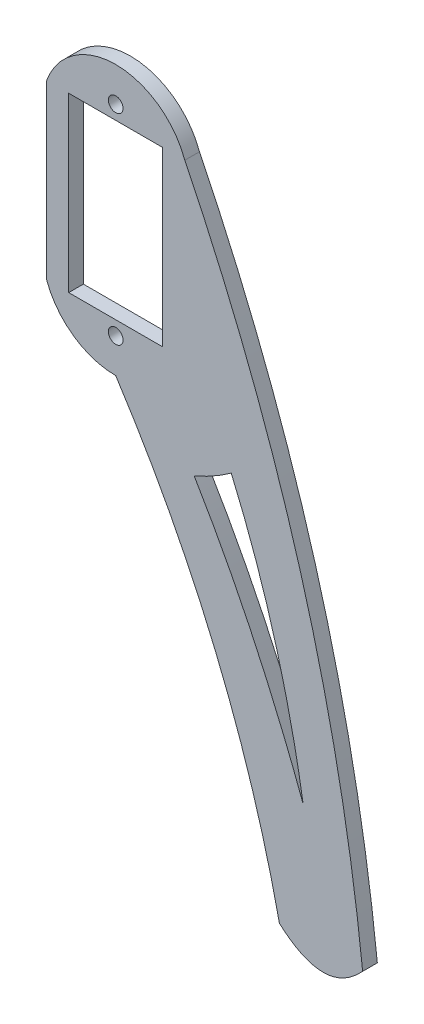
ISO-10303-21;
HEADER;
FILE_DESCRIPTION(('STEP AP214'),'2;1');
FILE_NAME('part.step','',(''),(''),'','','');
FILE_SCHEMA(('AUTOMOTIVE_DESIGN { 1 0 10303 214 1 1 1 1 }'));
ENDSEC;
DATA;
#1=APPLICATION_CONTEXT('core data for automotive mechanical design processes');
#2=APPLICATION_PROTOCOL_DEFINITION('international standard','automotive_design',2000,#1);
#3=PRODUCT_CONTEXT('',#1,'mechanical');
#4=PRODUCT('Part','Part','',(#3));
#5=PRODUCT_RELATED_PRODUCT_CATEGORY('part','',(#4));
#6=PRODUCT_DEFINITION_FORMATION('','',#4);
#7=PRODUCT_DEFINITION_CONTEXT('part definition',#1,'design');
#8=PRODUCT_DEFINITION('design','',#6,#7);
#9=PRODUCT_DEFINITION_SHAPE('','',#8);
#10=(LENGTH_UNIT() NAMED_UNIT(*) SI_UNIT(.MILLI.,.METRE.));
#11=(NAMED_UNIT(*) PLANE_ANGLE_UNIT() SI_UNIT($,.RADIAN.));
#12=(NAMED_UNIT(*) SI_UNIT($,.STERADIAN.) SOLID_ANGLE_UNIT());
#13=UNCERTAINTY_MEASURE_WITH_UNIT(LENGTH_MEASURE(1.E-05),#10,'distance_accuracy_value','');
#14=(GEOMETRIC_REPRESENTATION_CONTEXT(3) GLOBAL_UNCERTAINTY_ASSIGNED_CONTEXT((#13)) GLOBAL_UNIT_ASSIGNED_CONTEXT((#10,
#11,#12)) REPRESENTATION_CONTEXT('',''));
#15=CARTESIAN_POINT('',(0.,0.,0.));
#16=DIRECTION('',(0.,0.,1.));
#17=DIRECTION('',(1.,0.,0.));
#18=AXIS2_PLACEMENT_3D('',#15,#16,#17);
#19=CARTESIAN_POINT('',(10.6799037739265,-24.8169992032956,2.));
#20=CARTESIAN_POINT('',(19.0881977067008,-38.8472866210314,2.));
#21=CARTESIAN_POINT('',(25.511369442718,-56.0771893153706,2.));
#22=B_SPLINE_CURVE_WITH_KNOTS('',2,(#19,#20,#21),.UNSPECIFIED.,.F.,.F.,(3,3),(0.,1.),.UNSPECIFIED.);
#23=DIRECTION('',(0.,0.,-1.));
#24=VECTOR('',#23,1.);
#25=SURFACE_OF_LINEAR_EXTRUSION('',#22,#24);
#26=CARTESIAN_POINT('',(10.6799037739265,-24.8169992032956,0.));
#27=CARTESIAN_POINT('',(19.0881977067008,-38.8472866210314,0.));
#28=CARTESIAN_POINT('',(25.511369442718,-56.0771893153706,0.));
#29=B_SPLINE_CURVE_WITH_KNOTS('',2,(#26,#27,#28),.UNSPECIFIED.,.F.,.F.,(3,3),(0.,1.),.UNSPECIFIED.);
#30=CARTESIAN_POINT('',(10.6799037739265,-24.8169992032956,0.));
#31=VERTEX_POINT('',#30);
#32=CARTESIAN_POINT('',(25.511369442718,-56.0771893153706,0.));
#33=VERTEX_POINT('',#32);
#34=EDGE_CURVE('E145',#31,#33,#29,.T.);
#35=ORIENTED_EDGE('',*,*,#34,.F.);
#36=DIRECTION('',(0.,0.,-1.));
#37=VECTOR('',#36,1.);
#38=CARTESIAN_POINT('',(10.6799037739265,-24.8169992032956,2.));
#39=LINE('',#38,#37);
#40=CARTESIAN_POINT('',(10.6799037739265,-24.8169992032956,2.));
#41=VERTEX_POINT('',#40);
#42=EDGE_CURVE('E11',#41,#31,#39,.T.);
#43=ORIENTED_EDGE('',*,*,#42,.F.);
#44=CARTESIAN_POINT('',(25.511369442718,-56.0771893153706,2.));
#45=VERTEX_POINT('',#44);
#46=EDGE_CURVE('E144',#41,#45,#22,.T.);
#47=ORIENTED_EDGE('',*,*,#46,.T.);
#48=DIRECTION('',(0.,0.,-1.));
#49=VECTOR('',#48,1.);
#50=CARTESIAN_POINT('',(25.511369442718,-56.0771893153706,2.));
#51=LINE('',#50,#49);
#52=EDGE_CURVE('E107',#45,#33,#51,.T.);
#53=ORIENTED_EDGE('',*,*,#52,.T.);
#54=EDGE_LOOP('',(#35,#43,#47,#53));
#55=FACE_BOUND('',#54,.T.);
#56=ADVANCED_FACE('F38',(#55),#25,.T.);
#57=CARTESIAN_POINT('',(0.,0.,2.));
#58=DIRECTION('',(0.,0.,-1.));
#59=DIRECTION('',(-1.,0.,0.));
#60=AXIS2_PLACEMENT_3D('',#57,#58,#59);
#61=CYLINDRICAL_SURFACE('',#60,27.0174720149148);
#62=CARTESIAN_POINT('',(0.,0.,0.));
#63=DIRECTION('',(0.,0.,1.));
#64=DIRECTION('',(1.,0.,0.));
#65=AXIS2_PLACEMENT_3D('',#62,#63,#64);
#66=CIRCLE('',#65,27.0174720149148);
#67=CARTESIAN_POINT('',(15.7256652386891,-21.9692340985613,0.));
#68=VERTEX_POINT('',#67);
#69=EDGE_CURVE('E243',#31,#68,#66,.T.);
#70=ORIENTED_EDGE('',*,*,#69,.T.);
#71=DIRECTION('',(0.,0.,-1.));
#72=VECTOR('',#71,1.);
#73=CARTESIAN_POINT('',(15.7256652386891,-21.9692340985613,2.));
#74=LINE('',#73,#72);
#75=CARTESIAN_POINT('',(15.7256652386891,-21.9692340985613,2.));
#76=VERTEX_POINT('',#75);
#77=EDGE_CURVE('E48',#76,#68,#74,.T.);
#78=ORIENTED_EDGE('',*,*,#77,.F.);
#79=CARTESIAN_POINT('',(0.,0.,2.));
#80=DIRECTION('',(0.,0.,1.));
#81=DIRECTION('',(1.,0.,0.));
#82=AXIS2_PLACEMENT_3D('',#79,#80,#81);
#83=CIRCLE('',#82,27.0174720149148);
#84=EDGE_CURVE('E149',#41,#76,#83,.T.);
#85=ORIENTED_EDGE('',*,*,#84,.F.);
#86=ORIENTED_EDGE('',*,*,#42,.T.);
#87=EDGE_LOOP('',(#70,#78,#85,#86));
#88=FACE_BOUND('',#87,.T.);
#89=ADVANCED_FACE('F150',(#88),#61,.T.);
#90=CARTESIAN_POINT('',(-9.4,0.,2.));
#91=DIRECTION('',(-1.,0.,0.));
#92=DIRECTION('',(0.,0.,1.));
#93=AXIS2_PLACEMENT_3D('',#90,#91,#92);
#94=PLANE('',#93);
#95=DIRECTION('',(0.,1.,0.));
#96=VECTOR('',#95,1.);
#97=CARTESIAN_POINT('',(-9.4,0.,0.));
#98=LINE('',#97,#96);
#99=CARTESIAN_POINT('',(-9.4,-11.75,0.));
#100=VERTEX_POINT('',#99);
#101=CARTESIAN_POINT('',(-9.4,11.75,0.));
#102=VERTEX_POINT('',#101);
#103=EDGE_CURVE('E295',#100,#102,#98,.T.);
#104=ORIENTED_EDGE('',*,*,#103,.F.);
#105=DIRECTION('',(0.,0.,-1.));
#106=VECTOR('',#105,1.);
#107=CARTESIAN_POINT('',(-9.4,-11.75,2.));
#108=LINE('',#107,#106);
#109=CARTESIAN_POINT('',(-9.4,-11.75,2.));
#110=VERTEX_POINT('',#109);
#111=EDGE_CURVE('E221',#110,#100,#108,.T.);
#112=ORIENTED_EDGE('',*,*,#111,.F.);
#113=DIRECTION('',(0.,1.,0.));
#114=VECTOR('',#113,1.);
#115=CARTESIAN_POINT('',(-9.4,0.,2.));
#116=LINE('',#115,#114);
#117=CARTESIAN_POINT('',(-9.4,11.75,2.));
#118=VERTEX_POINT('',#117);
#119=EDGE_CURVE('E219',#110,#118,#116,.T.);
#120=ORIENTED_EDGE('',*,*,#119,.T.);
#121=DIRECTION('',(0.,0.,-1.));
#122=VECTOR('',#121,1.);
#123=CARTESIAN_POINT('',(-9.4,11.75,2.));
#124=LINE('',#123,#122);
#125=EDGE_CURVE('E211',#118,#102,#124,.T.);
#126=ORIENTED_EDGE('',*,*,#125,.T.);
#127=EDGE_LOOP('',(#104,#112,#120,#126));
#128=FACE_BOUND('',#127,.T.);
#129=ADVANCED_FACE('F220',(#128),#94,.T.);
#130=CARTESIAN_POINT('',(0.,-8.33825557815361,2.));
#131=DIRECTION('',(0.,0.,-1.));
#132=DIRECTION('',(-1.,0.,0.));
#133=AXIS2_PLACEMENT_3D('',#130,#131,#132);
#134=CYLINDRICAL_SURFACE('',#133,10.);
#135=CARTESIAN_POINT('',(0.,-8.33825557815361,0.));
#136=DIRECTION('',(0.,0.,1.));
#137=DIRECTION('',(1.,0.,0.));
#138=AXIS2_PLACEMENT_3D('',#135,#136,#137);
#139=CIRCLE('',#138,10.);
#140=CARTESIAN_POINT('',(0.,-18.3382555781536,0.));
#141=VERTEX_POINT('',#140);
#142=EDGE_CURVE('E297',#100,#141,#139,.T.);
#143=ORIENTED_EDGE('',*,*,#142,.T.);
#144=DIRECTION('',(0.,0.,-1.));
#145=VECTOR('',#144,1.);
#146=CARTESIAN_POINT('',(0.,-18.3382555781536,2.));
#147=LINE('',#146,#145);
#148=CARTESIAN_POINT('',(0.,-18.3382555781536,2.));
#149=VERTEX_POINT('',#148);
#150=EDGE_CURVE('E260',#149,#141,#147,.T.);
#151=ORIENTED_EDGE('',*,*,#150,.F.);
#152=CARTESIAN_POINT('',(0.,-8.33825557815361,2.));
#153=DIRECTION('',(0.,0.,1.));
#154=DIRECTION('',(1.,0.,0.));
#155=AXIS2_PLACEMENT_3D('',#152,#153,#154);
#156=CIRCLE('',#155,10.);
#157=EDGE_CURVE('E224',#110,#149,#156,.T.);
#158=ORIENTED_EDGE('',*,*,#157,.F.);
#159=ORIENTED_EDGE('',*,*,#111,.T.);
#160=EDGE_LOOP('',(#143,#151,#158,#159));
#161=FACE_BOUND('',#160,.T.);
#162=ADVANCED_FACE('F360',(#161),#134,.T.);
#163=CARTESIAN_POINT('',(-134.091519092015,-105.627799669046,2.));
#164=DIRECTION('',(0.,0.,-1.));
#165=DIRECTION('',(-1.,0.,0.));
#166=AXIS2_PLACEMENT_3D('',#163,#164,#165);
#167=CYLINDRICAL_SURFACE('',#166,160.);
#168=CARTESIAN_POINT('',(-134.091519092015,-105.627799669046,0.));
#169=DIRECTION('',(0.,0.,1.));
#170=DIRECTION('',(1.,0.,0.));
#171=AXIS2_PLACEMENT_3D('',#168,#169,#170);
#172=CIRCLE('',#171,160.);
#173=CARTESIAN_POINT('',(22.2807760551242,-71.75,0.));
#174=VERTEX_POINT('',#173);
#175=EDGE_CURVE('E300',#141,#174,#172,.F.);
#176=ORIENTED_EDGE('',*,*,#175,.T.);
#177=DIRECTION('',(0.,0.,-1.));
#178=VECTOR('',#177,1.);
#179=CARTESIAN_POINT('',(22.2807760551242,-71.75,2.));
#180=LINE('',#179,#178);
#181=CARTESIAN_POINT('',(22.2807760551242,-71.75,2.));
#182=VERTEX_POINT('',#181);
#183=EDGE_CURVE('E258',#182,#174,#180,.T.);
#184=ORIENTED_EDGE('',*,*,#183,.F.);
#185=CARTESIAN_POINT('',(-134.091519092015,-105.627799669046,2.));
#186=DIRECTION('',(0.,0.,1.));
#187=DIRECTION('',(1.,0.,0.));
#188=AXIS2_PLACEMENT_3D('',#185,#186,#187);
#189=CIRCLE('',#188,160.);
#190=EDGE_CURVE('E195',#149,#182,#189,.F.);
#191=ORIENTED_EDGE('',*,*,#190,.F.);
#192=ORIENTED_EDGE('',*,*,#150,.T.);
#193=EDGE_LOOP('',(#176,#184,#191,#192));
#194=FACE_BOUND('',#193,.T.);
#195=ADVANCED_FACE('F186',(#194),#167,.F.);
#196=CARTESIAN_POINT('',(33.6079623547485,-71.75,2.));
#197=CARTESIAN_POINT('',(28.503418883784,-77.3391353795696,2.));
#198=CARTESIAN_POINT('',(22.2807760551242,-71.75,2.));
#199=B_SPLINE_CURVE_WITH_KNOTS('',2,(#196,#197,#198),.UNSPECIFIED.,.F.,.F.,(3,3),(0.,1.),.UNSPECIFIED.);
#200=DIRECTION('',(0.,0.,-1.));
#201=VECTOR('',#200,1.);
#202=SURFACE_OF_LINEAR_EXTRUSION('',#199,#201);
#203=CARTESIAN_POINT('',(33.6079623547485,-71.75,0.));
#204=CARTESIAN_POINT('',(28.503418883784,-77.3391353795696,0.));
#205=CARTESIAN_POINT('',(22.2807760551242,-71.75,0.));
#206=B_SPLINE_CURVE_WITH_KNOTS('',2,(#203,#204,#205),.UNSPECIFIED.,.F.,.F.,(3,3),(0.,1.),.UNSPECIFIED.);
#207=CARTESIAN_POINT('',(33.6079623547485,-71.75,0.));
#208=VERTEX_POINT('',#207);
#209=EDGE_CURVE('E303',#208,#174,#206,.T.);
#210=ORIENTED_EDGE('',*,*,#209,.F.);
#211=DIRECTION('',(0.,0.,-1.));
#212=VECTOR('',#211,1.);
#213=CARTESIAN_POINT('',(33.6079623547485,-71.75,2.));
#214=LINE('',#213,#212);
#215=CARTESIAN_POINT('',(33.6079623547485,-71.75,2.));
#216=VERTEX_POINT('',#215);
#217=EDGE_CURVE('E203',#216,#208,#214,.T.);
#218=ORIENTED_EDGE('',*,*,#217,.F.);
#219=EDGE_CURVE('E189',#216,#182,#199,.T.);
#220=ORIENTED_EDGE('',*,*,#219,.T.);
#221=ORIENTED_EDGE('',*,*,#183,.T.);
#222=EDGE_LOOP('',(#210,#218,#220,#221));
#223=FACE_BOUND('',#222,.T.);
#224=ADVANCED_FACE('F181',(#223),#202,.T.);
#225=CARTESIAN_POINT('',(-214.951183758744,-98.5520686390348,2.));
#226=DIRECTION('',(0.,0.,-1.));
#227=DIRECTION('',(-1.,0.,0.));
#228=AXIS2_PLACEMENT_3D('',#225,#226,#227);
#229=CYLINDRICAL_SURFACE('',#228,250.);
#230=CARTESIAN_POINT('',(-214.951183758744,-98.5520686390348,0.));
#231=DIRECTION('',(0.,0.,1.));
#232=DIRECTION('',(1.,0.,0.));
#233=AXIS2_PLACEMENT_3D('',#230,#231,#232);
#234=CIRCLE('',#233,250.);
#235=CARTESIAN_POINT('',(9.4,11.75,0.));
#236=VERTEX_POINT('',#235);
#237=EDGE_CURVE('E308',#236,#208,#234,.F.);
#238=ORIENTED_EDGE('',*,*,#237,.F.);
#239=DIRECTION('',(0.,0.,-1.));
#240=VECTOR('',#239,1.);
#241=CARTESIAN_POINT('',(9.4,11.75,2.));
#242=LINE('',#241,#240);
#243=CARTESIAN_POINT('',(9.4,11.75,2.));
#244=VERTEX_POINT('',#243);
#245=EDGE_CURVE('E205',#244,#236,#242,.T.);
#246=ORIENTED_EDGE('',*,*,#245,.F.);
#247=CARTESIAN_POINT('',(-214.951183758744,-98.5520686390348,2.));
#248=DIRECTION('',(0.,0.,1.));
#249=DIRECTION('',(1.,0.,0.));
#250=AXIS2_PLACEMENT_3D('',#247,#248,#249);
#251=CIRCLE('',#250,250.);
#252=EDGE_CURVE('E156',#244,#216,#251,.F.);
#253=ORIENTED_EDGE('',*,*,#252,.T.);
#254=ORIENTED_EDGE('',*,*,#217,.T.);
#255=EDGE_LOOP('',(#238,#246,#253,#254));
#256=FACE_BOUND('',#255,.T.);
#257=ADVANCED_FACE('F177',(#256),#229,.T.);
#258=CARTESIAN_POINT('',(0.,-11.75,2.));
#259=DIRECTION('',(0.,-1.,0.));
#260=DIRECTION('',(0.,0.,-1.));
#261=AXIS2_PLACEMENT_3D('',#258,#259,#260);
#262=PLANE('',#261);
#263=DIRECTION('',(-1.,0.,0.));
#264=VECTOR('',#263,1.);
#265=CARTESIAN_POINT('',(0.,-11.75,0.));
#266=LINE('',#265,#264);
#267=CARTESIAN_POINT('',(6.4,-11.75,0.));
#268=VERTEX_POINT('',#267);
#269=CARTESIAN_POINT('',(-6.4,-11.75,0.));
#270=VERTEX_POINT('',#269);
#271=EDGE_CURVE('E279',#268,#270,#266,.T.);
#272=ORIENTED_EDGE('',*,*,#271,.T.);
#273=DIRECTION('',(0.,0.,-1.));
#274=VECTOR('',#273,1.);
#275=CARTESIAN_POINT('',(-6.4,-11.75,2.));
#276=LINE('',#275,#274);
#277=CARTESIAN_POINT('',(-6.4,-11.75,2.));
#278=VERTEX_POINT('',#277);
#279=EDGE_CURVE('E42',#278,#270,#276,.T.);
#280=ORIENTED_EDGE('',*,*,#279,.F.);
#281=DIRECTION('',(-1.,0.,0.));
#282=VECTOR('',#281,1.);
#283=CARTESIAN_POINT('',(0.,-11.75,2.));
#284=LINE('',#283,#282);
#285=CARTESIAN_POINT('',(6.4,-11.75,2.));
#286=VERTEX_POINT('',#285);
#287=EDGE_CURVE('E234',#286,#278,#284,.T.);
#288=ORIENTED_EDGE('',*,*,#287,.F.);
#289=DIRECTION('',(0.,0.,-1.));
#290=VECTOR('',#289,1.);
#291=CARTESIAN_POINT('',(6.4,-11.75,2.));
#292=LINE('',#291,#290);
#293=EDGE_CURVE('E264',#286,#268,#292,.T.);
#294=ORIENTED_EDGE('',*,*,#293,.T.);
#295=EDGE_LOOP('',(#272,#280,#288,#294));
#296=FACE_BOUND('',#295,.T.);
#297=ADVANCED_FACE('F180',(#296),#262,.F.);
#298=CARTESIAN_POINT('',(-6.4,0.,2.));
#299=DIRECTION('',(-1.,0.,0.));
#300=DIRECTION('',(0.,0.,1.));
#301=AXIS2_PLACEMENT_3D('',#298,#299,#300);
#302=PLANE('',#301);
#303=DIRECTION('',(0.,1.,0.));
#304=VECTOR('',#303,1.);
#305=CARTESIAN_POINT('',(-6.4,0.,0.));
#306=LINE('',#305,#304);
#307=CARTESIAN_POINT('',(-6.4,11.75,0.));
#308=VERTEX_POINT('',#307);
#309=EDGE_CURVE('E274',#270,#308,#306,.T.);
#310=ORIENTED_EDGE('',*,*,#309,.T.);
#311=DIRECTION('',(0.,0.,-1.));
#312=VECTOR('',#311,1.);
#313=CARTESIAN_POINT('',(-6.4,11.75,2.));
#314=LINE('',#313,#312);
#315=CARTESIAN_POINT('',(-6.4,11.75,2.));
#316=VERTEX_POINT('',#315);
#317=EDGE_CURVE('E267',#316,#308,#314,.T.);
#318=ORIENTED_EDGE('',*,*,#317,.F.);
#319=DIRECTION('',(0.,1.,0.));
#320=VECTOR('',#319,1.);
#321=CARTESIAN_POINT('',(-6.4,0.,2.));
#322=LINE('',#321,#320);
#323=EDGE_CURVE('E115',#278,#316,#322,.T.);
#324=ORIENTED_EDGE('',*,*,#323,.F.);
#325=ORIENTED_EDGE('',*,*,#279,.T.);
#326=EDGE_LOOP('',(#310,#318,#324,#325));
#327=FACE_BOUND('',#326,.T.);
#328=ADVANCED_FACE('F273',(#327),#302,.F.);
#329=CARTESIAN_POINT('',(0.,11.75,2.));
#330=DIRECTION('',(0.,-1.,0.));
#331=DIRECTION('',(0.,0.,-1.));
#332=AXIS2_PLACEMENT_3D('',#329,#330,#331);
#333=PLANE('',#332);
#334=DIRECTION('',(-1.,0.,0.));
#335=VECTOR('',#334,1.);
#336=CARTESIAN_POINT('',(0.,11.75,0.));
#337=LINE('',#336,#335);
#338=CARTESIAN_POINT('',(6.4,11.75,0.));
#339=VERTEX_POINT('',#338);
#340=EDGE_CURVE('E285',#339,#308,#337,.T.);
#341=ORIENTED_EDGE('',*,*,#340,.F.);
#342=DIRECTION('',(0.,0.,-1.));
#343=VECTOR('',#342,1.);
#344=CARTESIAN_POINT('',(6.4,11.75,2.));
#345=LINE('',#344,#343);
#346=CARTESIAN_POINT('',(6.4,11.75,2.));
#347=VERTEX_POINT('',#346);
#348=EDGE_CURVE('E266',#347,#339,#345,.T.);
#349=ORIENTED_EDGE('',*,*,#348,.F.);
#350=DIRECTION('',(-1.,0.,0.));
#351=VECTOR('',#350,1.);
#352=CARTESIAN_POINT('',(0.,11.75,2.));
#353=LINE('',#352,#351);
#354=EDGE_CURVE('E228',#347,#316,#353,.T.);
#355=ORIENTED_EDGE('',*,*,#354,.T.);
#356=ORIENTED_EDGE('',*,*,#317,.T.);
#357=EDGE_LOOP('',(#341,#349,#355,#356));
#358=FACE_BOUND('',#357,.T.);
#359=ADVANCED_FACE('F175',(#358),#333,.T.);
#360=CARTESIAN_POINT('',(0.,8.3382555781536,2.));
#361=DIRECTION('',(0.,0.,-1.));
#362=DIRECTION('',(-1.,0.,0.));
#363=AXIS2_PLACEMENT_3D('',#360,#361,#362);
#364=CYLINDRICAL_SURFACE('',#363,10.);
#365=CARTESIAN_POINT('',(0.,8.3382555781536,0.));
#366=DIRECTION('',(0.,0.,1.));
#367=DIRECTION('',(1.,0.,0.));
#368=AXIS2_PLACEMENT_3D('',#365,#366,#367);
#369=CIRCLE('',#368,10.);
#370=EDGE_CURVE('E214',#102,#236,#369,.F.);
#371=ORIENTED_EDGE('',*,*,#370,.F.);
#372=ORIENTED_EDGE('',*,*,#125,.F.);
#373=CARTESIAN_POINT('',(0.,8.3382555781536,2.));
#374=DIRECTION('',(0.,0.,1.));
#375=DIRECTION('',(1.,0.,0.));
#376=AXIS2_PLACEMENT_3D('',#373,#374,#375);
#377=CIRCLE('',#376,10.);
#378=EDGE_CURVE('E153',#118,#244,#377,.F.);
#379=ORIENTED_EDGE('',*,*,#378,.T.);
#380=ORIENTED_EDGE('',*,*,#245,.T.);
#381=EDGE_LOOP('',(#371,#372,#379,#380));
#382=FACE_BOUND('',#381,.T.);
#383=ADVANCED_FACE('F171',(#382),#364,.T.);
#384=CARTESIAN_POINT('',(6.4,0.,2.));
#385=DIRECTION('',(-1.,0.,0.));
#386=DIRECTION('',(0.,0.,1.));
#387=AXIS2_PLACEMENT_3D('',#384,#385,#386);
#388=PLANE('',#387);
#389=DIRECTION('',(0.,1.,0.));
#390=VECTOR('',#389,1.);
#391=CARTESIAN_POINT('',(6.4,0.,0.));
#392=LINE('',#391,#390);
#393=EDGE_CURVE('E293',#268,#339,#392,.T.);
#394=ORIENTED_EDGE('',*,*,#393,.F.);
#395=ORIENTED_EDGE('',*,*,#293,.F.);
#396=DIRECTION('',(0.,1.,0.));
#397=VECTOR('',#396,1.);
#398=CARTESIAN_POINT('',(6.4,0.,2.));
#399=LINE('',#398,#397);
#400=EDGE_CURVE('E225',#286,#347,#399,.T.);
#401=ORIENTED_EDGE('',*,*,#400,.T.);
#402=ORIENTED_EDGE('',*,*,#348,.T.);
#403=EDGE_LOOP('',(#394,#395,#401,#402));
#404=FACE_BOUND('',#403,.T.);
#405=ADVANCED_FACE('F174',(#404),#388,.T.);
#406=CARTESIAN_POINT('',(0.,-13.65,2.));
#407=DIRECTION('',(0.,0.,-1.));
#408=DIRECTION('',(-1.,0.,0.));
#409=AXIS2_PLACEMENT_3D('',#406,#407,#408);
#410=CYLINDRICAL_SURFACE('',#409,1.);
#411=CARTESIAN_POINT('',(0.,-13.65,2.));
#412=DIRECTION('',(0.,0.,1.));
#413=DIRECTION('',(1.,0.,0.));
#414=AXIS2_PLACEMENT_3D('',#411,#412,#413);
#415=CIRCLE('',#414,1.);
#416=CARTESIAN_POINT('',(1.,-13.65,2.));
#417=VERTEX_POINT('',#416);
#418=EDGE_CURVE('E236',#417,#417,#415,.T.);
#419=ORIENTED_EDGE('',*,*,#418,.T.);
#420=EDGE_LOOP('',(#419));
#421=FACE_BOUND('',#420,.T.);
#422=CARTESIAN_POINT('',(0.,-13.65,0.));
#423=DIRECTION('',(0.,0.,1.));
#424=DIRECTION('',(1.,0.,0.));
#425=AXIS2_PLACEMENT_3D('',#422,#423,#424);
#426=CIRCLE('',#425,1.);
#427=CARTESIAN_POINT('',(1.,-13.65,0.));
#428=VERTEX_POINT('',#427);
#429=EDGE_CURVE('E283',#428,#428,#426,.T.);
#430=ORIENTED_EDGE('',*,*,#429,.F.);
#431=EDGE_LOOP('',(#430));
#432=FACE_BOUND('',#431,.T.);
#433=ADVANCED_FACE('F340',(#421,#432),#410,.F.);
#434=CARTESIAN_POINT('',(0.,13.65,2.));
#435=DIRECTION('',(0.,0.,-1.));
#436=DIRECTION('',(-1.,0.,0.));
#437=AXIS2_PLACEMENT_3D('',#434,#435,#436);
#438=CYLINDRICAL_SURFACE('',#437,1.);
#439=CARTESIAN_POINT('',(0.,13.65,2.));
#440=DIRECTION('',(0.,0.,1.));
#441=DIRECTION('',(1.,0.,0.));
#442=AXIS2_PLACEMENT_3D('',#439,#440,#441);
#443=CIRCLE('',#442,1.);
#444=CARTESIAN_POINT('',(1.,13.65,2.));
#445=VERTEX_POINT('',#444);
#446=EDGE_CURVE('E239',#445,#445,#443,.F.);
#447=ORIENTED_EDGE('',*,*,#446,.F.);
#448=EDGE_LOOP('',(#447));
#449=FACE_BOUND('',#448,.T.);
#450=CARTESIAN_POINT('',(0.,13.65,0.));
#451=DIRECTION('',(0.,0.,1.));
#452=DIRECTION('',(1.,0.,0.));
#453=AXIS2_PLACEMENT_3D('',#450,#451,#452);
#454=CIRCLE('',#453,1.);
#455=CARTESIAN_POINT('',(1.,13.65,0.));
#456=VERTEX_POINT('',#455);
#457=EDGE_CURVE('E288',#456,#456,#454,.F.);
#458=ORIENTED_EDGE('',*,*,#457,.T.);
#459=EDGE_LOOP('',(#458));
#460=FACE_BOUND('',#459,.T.);
#461=ADVANCED_FACE('F40',(#449,#460),#438,.F.);
#462=CARTESIAN_POINT('',(15.7256652386891,-21.9692340985613,2.));
#463=CARTESIAN_POINT('',(22.5216023688972,-37.7122103555116,2.));
#464=CARTESIAN_POINT('',(25.511369442718,-56.0771893153706,2.));
#465=B_SPLINE_CURVE_WITH_KNOTS('',2,(#462,#463,#464),.UNSPECIFIED.,.F.,.F.,(3,3),(0.,1.),.UNSPECIFIED.);
#466=DIRECTION('',(0.,0.,-1.));
#467=VECTOR('',#466,1.);
#468=SURFACE_OF_LINEAR_EXTRUSION('',#465,#467);
#469=CARTESIAN_POINT('',(15.7256652386891,-21.9692340985613,0.));
#470=CARTESIAN_POINT('',(22.5216023688972,-37.7122103555116,0.));
#471=CARTESIAN_POINT('',(25.511369442718,-56.0771893153706,0.));
#472=B_SPLINE_CURVE_WITH_KNOTS('',2,(#469,#470,#471),.UNSPECIFIED.,.F.,.F.,(3,3),(0.,1.),.UNSPECIFIED.);
#473=EDGE_CURVE('E100',#68,#33,#472,.T.);
#474=ORIENTED_EDGE('',*,*,#473,.T.);
#475=ORIENTED_EDGE('',*,*,#52,.F.);
#476=EDGE_CURVE('E57',#76,#45,#465,.T.);
#477=ORIENTED_EDGE('',*,*,#476,.F.);
#478=ORIENTED_EDGE('',*,*,#77,.T.);
#479=EDGE_LOOP('',(#474,#475,#477,#478));
#480=FACE_BOUND('',#479,.T.);
#481=ADVANCED_FACE('F326',(#480),#468,.F.);
#482=CARTESIAN_POINT('',(0.,0.,2.));
#483=DIRECTION('',(0.,0.,1.));
#484=DIRECTION('',(1.,0.,0.));
#485=AXIS2_PLACEMENT_3D('',#482,#483,#484);
#486=PLANE('',#485);
#487=ORIENTED_EDGE('',*,*,#446,.T.);
#488=EDGE_LOOP('',(#487));
#489=FACE_BOUND('',#488,.T.);
#490=ORIENTED_EDGE('',*,*,#418,.F.);
#491=EDGE_LOOP('',(#490));
#492=FACE_BOUND('',#491,.T.);
#493=ORIENTED_EDGE('',*,*,#287,.T.);
#494=ORIENTED_EDGE('',*,*,#323,.T.);
#495=ORIENTED_EDGE('',*,*,#354,.F.);
#496=ORIENTED_EDGE('',*,*,#400,.F.);
#497=EDGE_LOOP('',(#493,#494,#495,#496));
#498=FACE_BOUND('',#497,.T.);
#499=ORIENTED_EDGE('',*,*,#119,.F.);
#500=ORIENTED_EDGE('',*,*,#157,.T.);
#501=ORIENTED_EDGE('',*,*,#190,.T.);
#502=ORIENTED_EDGE('',*,*,#219,.F.);
#503=ORIENTED_EDGE('',*,*,#252,.F.);
#504=ORIENTED_EDGE('',*,*,#378,.F.);
#505=EDGE_LOOP('',(#499,#500,#501,#502,#503,#504));
#506=FACE_BOUND('',#505,.T.);
#507=ORIENTED_EDGE('',*,*,#46,.F.);
#508=ORIENTED_EDGE('',*,*,#84,.T.);
#509=ORIENTED_EDGE('',*,*,#476,.T.);
#510=EDGE_LOOP('',(#507,#508,#509));
#511=FACE_BOUND('',#510,.T.);
#512=ADVANCED_FACE('F152',(#489,#492,#498,#506,#511),#486,.T.);
#513=CARTESIAN_POINT('',(0.,0.,0.));
#514=DIRECTION('',(0.,0.,1.));
#515=DIRECTION('',(1.,0.,0.));
#516=AXIS2_PLACEMENT_3D('',#513,#514,#515);
#517=PLANE('',#516);
#518=ORIENTED_EDGE('',*,*,#457,.F.);
#519=EDGE_LOOP('',(#518));
#520=FACE_BOUND('',#519,.T.);
#521=ORIENTED_EDGE('',*,*,#429,.T.);
#522=EDGE_LOOP('',(#521));
#523=FACE_BOUND('',#522,.T.);
#524=ORIENTED_EDGE('',*,*,#271,.F.);
#525=ORIENTED_EDGE('',*,*,#393,.T.);
#526=ORIENTED_EDGE('',*,*,#340,.T.);
#527=ORIENTED_EDGE('',*,*,#309,.F.);
#528=EDGE_LOOP('',(#524,#525,#526,#527));
#529=FACE_BOUND('',#528,.T.);
#530=ORIENTED_EDGE('',*,*,#103,.T.);
#531=ORIENTED_EDGE('',*,*,#370,.T.);
#532=ORIENTED_EDGE('',*,*,#237,.T.);
#533=ORIENTED_EDGE('',*,*,#209,.T.);
#534=ORIENTED_EDGE('',*,*,#175,.F.);
#535=ORIENTED_EDGE('',*,*,#142,.F.);
#536=EDGE_LOOP('',(#530,#531,#532,#533,#534,#535));
#537=FACE_BOUND('',#536,.T.);
#538=ORIENTED_EDGE('',*,*,#34,.T.);
#539=ORIENTED_EDGE('',*,*,#473,.F.);
#540=ORIENTED_EDGE('',*,*,#69,.F.);
#541=EDGE_LOOP('',(#538,#539,#540));
#542=FACE_BOUND('',#541,.T.);
#543=ADVANCED_FACE('F319',(#520,#523,#529,#537,#542),#517,.F.);
#544=CLOSED_SHELL('',(#56,#89,#129,#162,#195,#224,#257,#297,#328,#359,#383,#405,#433,#461,#481,
#512,#543));
#545=MANIFOLD_SOLID_BREP('B2',#544);
#546=ADVANCED_BREP_SHAPE_REPRESENTATION('',(#18,#545),#14);
#547=SHAPE_DEFINITION_REPRESENTATION(#9,#546);
ENDSEC;
END-ISO-10303-21;
